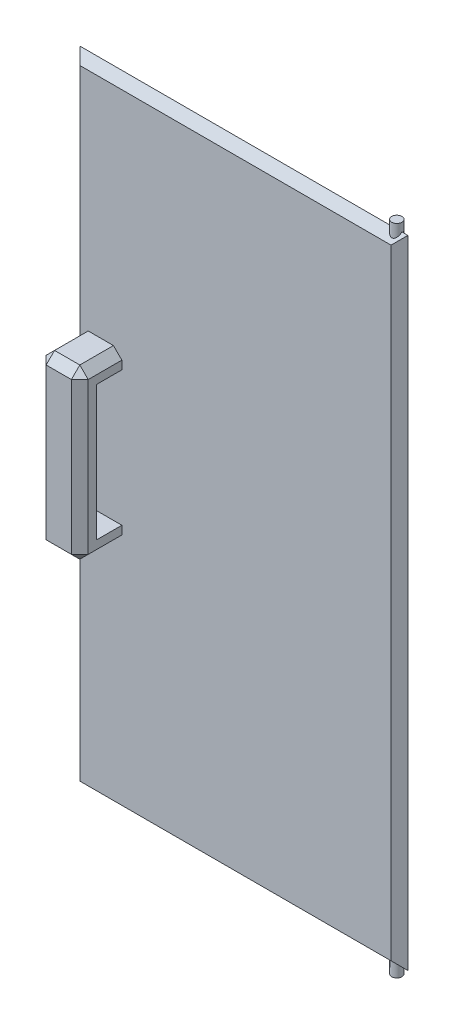
ISO-10303-21;
HEADER;
FILE_DESCRIPTION(('STEP AP214'),'2;1');
FILE_NAME('part.step','',(''),(''),'','','');
FILE_SCHEMA(('AUTOMOTIVE_DESIGN { 1 0 10303 214 1 1 1 1 }'));
ENDSEC;
DATA;
#1=APPLICATION_CONTEXT('core data for automotive mechanical design processes');
#2=APPLICATION_PROTOCOL_DEFINITION('international standard','automotive_design',2000,#1);
#3=PRODUCT_CONTEXT('',#1,'mechanical');
#4=PRODUCT('Part','Part','',(#3));
#5=PRODUCT_RELATED_PRODUCT_CATEGORY('part','',(#4));
#6=PRODUCT_DEFINITION_FORMATION('','',#4);
#7=PRODUCT_DEFINITION_CONTEXT('part definition',#1,'design');
#8=PRODUCT_DEFINITION('design','',#6,#7);
#9=PRODUCT_DEFINITION_SHAPE('','',#8);
#10=(LENGTH_UNIT() NAMED_UNIT(*) SI_UNIT(.MILLI.,.METRE.));
#11=(NAMED_UNIT(*) PLANE_ANGLE_UNIT() SI_UNIT($,.RADIAN.));
#12=(NAMED_UNIT(*) SI_UNIT($,.STERADIAN.) SOLID_ANGLE_UNIT());
#13=UNCERTAINTY_MEASURE_WITH_UNIT(LENGTH_MEASURE(1.E-05),#10,'distance_accuracy_value','');
#14=(GEOMETRIC_REPRESENTATION_CONTEXT(3) GLOBAL_UNCERTAINTY_ASSIGNED_CONTEXT((#13)) GLOBAL_UNIT_ASSIGNED_CONTEXT((#10,
#11,#12)) REPRESENTATION_CONTEXT('',''));
#15=CARTESIAN_POINT('',(0.,0.,0.));
#16=DIRECTION('',(0.,0.,1.));
#17=DIRECTION('',(1.,0.,0.));
#18=AXIS2_PLACEMENT_3D('',#15,#16,#17);
#19=CARTESIAN_POINT('',(12.8905936877682,0.,70.));
#20=DIRECTION('',(-1.,0.,0.));
#21=DIRECTION('',(0.,0.,1.));
#22=AXIS2_PLACEMENT_3D('',#19,#20,#21);
#23=PLANE('',#22);
#24=DIRECTION('',(0.,-1.,0.));
#25=VECTOR('',#24,1.);
#26=CARTESIAN_POINT('',(12.8905936877682,-458.84384057971,60.));
#27=LINE('',#26,#25);
#28=CARTESIAN_POINT('',(12.8905936877682,-268.84384057971,60.));
#29=VERTEX_POINT('',#28);
#30=CARTESIAN_POINT('',(12.8905936877682,-448.84384057971,60.));
#31=VERTEX_POINT('',#30);
#32=EDGE_CURVE('E396',#29,#31,#27,.T.);
#33=ORIENTED_EDGE('',*,*,#32,.T.);
#34=DIRECTION('',(0.,0.,-1.));
#35=VECTOR('',#34,1.);
#36=CARTESIAN_POINT('',(12.8905936877682,-448.84384057971,70.));
#37=LINE('',#36,#35);
#38=CARTESIAN_POINT('',(12.8905936877682,-448.84384057971,20.));
#39=VERTEX_POINT('',#38);
#40=EDGE_CURVE('E399',#31,#39,#37,.T.);
#41=ORIENTED_EDGE('',*,*,#40,.T.);
#42=DIRECTION('',(0.,1.,0.));
#43=VECTOR('',#42,1.);
#44=CARTESIAN_POINT('',(12.8905936877682,0.,20.));
#45=LINE('',#44,#43);
#46=CARTESIAN_POINT('',(12.8905936877682,-438.84384057971,20.));
#47=VERTEX_POINT('',#46);
#48=EDGE_CURVE('E251',#39,#47,#45,.T.);
#49=ORIENTED_EDGE('',*,*,#48,.T.);
#50=DIRECTION('',(0.,0.,-1.));
#51=VECTOR('',#50,1.);
#52=CARTESIAN_POINT('',(12.8905936877682,-438.84384057971,70.));
#53=LINE('',#52,#51);
#54=CARTESIAN_POINT('',(12.8905936877682,-438.84384057971,50.));
#55=VERTEX_POINT('',#54);
#56=EDGE_CURVE('E242',#55,#47,#53,.T.);
#57=ORIENTED_EDGE('',*,*,#56,.F.);
#58=DIRECTION('',(0.,-1.,0.));
#59=VECTOR('',#58,1.);
#60=CARTESIAN_POINT('',(12.8905936877682,0.,50.));
#61=LINE('',#60,#59);
#62=CARTESIAN_POINT('',(12.8905936877682,-278.84384057971,50.));
#63=VERTEX_POINT('',#62);
#64=EDGE_CURVE('E233',#63,#55,#61,.T.);
#65=ORIENTED_EDGE('',*,*,#64,.F.);
#66=DIRECTION('',(0.,0.,1.));
#67=VECTOR('',#66,1.);
#68=CARTESIAN_POINT('',(12.8905936877682,-278.84384057971,70.));
#69=LINE('',#68,#67);
#70=CARTESIAN_POINT('',(12.8905936877682,-278.84384057971,20.));
#71=VERTEX_POINT('',#70);
#72=EDGE_CURVE('E200',#71,#63,#69,.T.);
#73=ORIENTED_EDGE('',*,*,#72,.F.);
#74=CARTESIAN_POINT('',(12.8905936877682,-268.84384057971,20.));
#75=VERTEX_POINT('',#74);
#76=EDGE_CURVE('E250',#71,#75,#45,.T.);
#77=ORIENTED_EDGE('',*,*,#76,.T.);
#78=DIRECTION('',(0.,0.,1.));
#79=VECTOR('',#78,1.);
#80=CARTESIAN_POINT('',(12.8905936877682,-268.84384057971,70.));
#81=LINE('',#80,#79);
#82=EDGE_CURVE('E393',#75,#29,#81,.T.);
#83=ORIENTED_EDGE('',*,*,#82,.T.);
#84=EDGE_LOOP('',(#33,#41,#49,#57,#65,#73,#77,#83));
#85=FACE_BOUND('',#84,.T.);
#86=ADVANCED_FACE('F45',(#85),#23,.F.);
#87=CARTESIAN_POINT('',(-37.1094063122318,0.,70.));
#88=DIRECTION('',(1.,0.,0.));
#89=DIRECTION('',(0.,0.,-1.));
#90=AXIS2_PLACEMENT_3D('',#87,#88,#89);
#91=PLANE('',#90);
#92=DIRECTION('',(0.,-1.,0.));
#93=VECTOR('',#92,1.);
#94=CARTESIAN_POINT('',(-37.1094063122318,0.,20.));
#95=LINE('',#94,#93);
#96=CARTESIAN_POINT('',(-37.1094063122318,-438.84384057971,20.));
#97=VERTEX_POINT('',#96);
#98=CARTESIAN_POINT('',(-37.1094063122318,-448.84384057971,20.));
#99=VERTEX_POINT('',#98);
#100=EDGE_CURVE('E258',#97,#99,#95,.T.);
#101=ORIENTED_EDGE('',*,*,#100,.T.);
#102=DIRECTION('',(0.,0.,1.));
#103=VECTOR('',#102,1.);
#104=CARTESIAN_POINT('',(-37.1094063122318,-448.84384057971,70.));
#105=LINE('',#104,#103);
#106=CARTESIAN_POINT('',(-37.1094063122318,-448.84384057971,60.));
#107=VERTEX_POINT('',#106);
#108=EDGE_CURVE('E381',#99,#107,#105,.T.);
#109=ORIENTED_EDGE('',*,*,#108,.T.);
#110=DIRECTION('',(0.,1.,0.));
#111=VECTOR('',#110,1.);
#112=CARTESIAN_POINT('',(-37.1094063122318,-258.84384057971,60.));
#113=LINE('',#112,#111);
#114=CARTESIAN_POINT('',(-37.1094063122318,-268.84384057971,60.));
#115=VERTEX_POINT('',#114);
#116=EDGE_CURVE('E377',#107,#115,#113,.T.);
#117=ORIENTED_EDGE('',*,*,#116,.T.);
#118=DIRECTION('',(0.,0.,-1.));
#119=VECTOR('',#118,1.);
#120=CARTESIAN_POINT('',(-37.1094063122318,-268.84384057971,70.));
#121=LINE('',#120,#119);
#122=CARTESIAN_POINT('',(-37.1094063122318,-268.84384057971,20.));
#123=VERTEX_POINT('',#122);
#124=EDGE_CURVE('E374',#115,#123,#121,.T.);
#125=ORIENTED_EDGE('',*,*,#124,.T.);
#126=CARTESIAN_POINT('',(-37.1094063122318,-278.84384057971,20.));
#127=VERTEX_POINT('',#126);
#128=EDGE_CURVE('E220',#123,#127,#95,.T.);
#129=ORIENTED_EDGE('',*,*,#128,.T.);
#130=DIRECTION('',(0.,0.,1.));
#131=VECTOR('',#130,1.);
#132=CARTESIAN_POINT('',(-37.1094063122318,-278.84384057971,0.));
#133=LINE('',#132,#131);
#134=CARTESIAN_POINT('',(-37.1094063122318,-278.84384057971,50.));
#135=VERTEX_POINT('',#134);
#136=EDGE_CURVE('E197',#127,#135,#133,.T.);
#137=ORIENTED_EDGE('',*,*,#136,.T.);
#138=DIRECTION('',(0.,-1.,0.));
#139=VECTOR('',#138,1.);
#140=CARTESIAN_POINT('',(-37.1094063122318,0.,50.));
#141=LINE('',#140,#139);
#142=CARTESIAN_POINT('',(-37.1094063122318,-438.84384057971,50.));
#143=VERTEX_POINT('',#142);
#144=EDGE_CURVE('E209',#135,#143,#141,.T.);
#145=ORIENTED_EDGE('',*,*,#144,.T.);
#146=DIRECTION('',(0.,0.,-1.));
#147=VECTOR('',#146,1.);
#148=CARTESIAN_POINT('',(-37.1094063122318,-438.84384057971,0.));
#149=LINE('',#148,#147);
#150=EDGE_CURVE('E215',#143,#97,#149,.T.);
#151=ORIENTED_EDGE('',*,*,#150,.T.);
#152=EDGE_LOOP('',(#101,#109,#117,#125,#129,#137,#145,#151));
#153=FACE_BOUND('',#152,.T.);
#154=ADVANCED_FACE('F217',(#153),#91,.F.);
#155=CARTESIAN_POINT('',(0.,0.,20.));
#156=DIRECTION('',(0.,0.,-1.));
#157=DIRECTION('',(-1.,0.,0.));
#158=AXIS2_PLACEMENT_3D('',#155,#156,#157);
#159=PLANE('',#158);
#160=ORIENTED_EDGE('',*,*,#76,.F.);
#161=DIRECTION('',(-1.,0.,0.));
#162=VECTOR('',#161,1.);
#163=CARTESIAN_POINT('',(93.8905936877682,-278.84384057971,20.));
#164=LINE('',#163,#162);
#165=EDGE_CURVE('E204',#71,#127,#164,.T.);
#166=ORIENTED_EDGE('',*,*,#165,.T.);
#167=DIRECTION('',(0.,-1.,0.));
#168=VECTOR('',#167,1.);
#169=CARTESIAN_POINT('',(-37.1094063122318,0.,20.));
#170=LINE('',#169,#168);
#171=EDGE_CURVE('E223',#127,#97,#170,.T.);
#172=ORIENTED_EDGE('',*,*,#171,.T.);
#173=DIRECTION('',(-1.,0.,0.));
#174=VECTOR('',#173,1.);
#175=CARTESIAN_POINT('',(93.8905936877682,-438.84384057971,20.));
#176=LINE('',#175,#174);
#177=EDGE_CURVE('E230',#47,#97,#176,.T.);
#178=ORIENTED_EDGE('',*,*,#177,.F.);
#179=ORIENTED_EDGE('',*,*,#48,.F.);
#180=DIRECTION('',(0.707106781186548,0.707106781186548,0.));
#181=VECTOR('',#180,1.);
#182=CARTESIAN_POINT('',(230.867217133739,-230.867217133739,20.));
#183=LINE('',#182,#181);
#184=CARTESIAN_POINT('',(2.89059368776819,-458.84384057971,20.));
#185=VERTEX_POINT('',#184);
#186=EDGE_CURVE('E415',#39,#185,#183,.F.);
#187=ORIENTED_EDGE('',*,*,#186,.T.);
#188=DIRECTION('',(1.,0.,0.));
#189=VECTOR('',#188,1.);
#190=CARTESIAN_POINT('',(0.,-458.84384057971,20.));
#191=LINE('',#190,#189);
#192=CARTESIAN_POINT('',(-27.1094063122318,-458.84384057971,20.));
#193=VERTEX_POINT('',#192);
#194=EDGE_CURVE('E246',#193,#185,#191,.T.);
#195=ORIENTED_EDGE('',*,*,#194,.F.);
#196=DIRECTION('',(0.707106781186548,-0.707106781186548,0.));
#197=VECTOR('',#196,1.);
#198=CARTESIAN_POINT('',(-242.976623445971,-242.976623445971,20.));
#199=LINE('',#198,#197);
#200=EDGE_CURVE('E411',#193,#99,#199,.F.);
#201=ORIENTED_EDGE('',*,*,#200,.T.);
#202=DIRECTION('',(0.,-1.,0.));
#203=VECTOR('',#202,1.);
#204=CARTESIAN_POINT('',(-37.1094063122318,0.,20.));
#205=LINE('',#204,#203);
#206=CARTESIAN_POINT('',(-37.1094063122318,-727.24384057971,20.));
#207=VERTEX_POINT('',#206);
#208=EDGE_CURVE('E65',#99,#207,#205,.T.);
#209=ORIENTED_EDGE('',*,*,#208,.T.);
#210=DIRECTION('',(1.,0.,0.));
#211=VECTOR('',#210,1.);
#212=CARTESIAN_POINT('',(0.,-727.24384057971,20.));
#213=LINE('',#212,#211);
#214=CARTESIAN_POINT('',(332.890593687768,-727.24384057971,20.));
#215=VERTEX_POINT('',#214);
#216=EDGE_CURVE('E294',#207,#215,#213,.T.);
#217=ORIENTED_EDGE('',*,*,#216,.T.);
#218=DIRECTION('',(0.,1.,0.));
#219=VECTOR('',#218,1.);
#220=CARTESIAN_POINT('',(332.890593687768,0.,20.));
#221=LINE('',#220,#219);
#222=CARTESIAN_POINT('',(332.890593687768,9.55615942028985,20.));
#223=VERTEX_POINT('',#222);
#224=EDGE_CURVE('E284',#215,#223,#221,.T.);
#225=ORIENTED_EDGE('',*,*,#224,.T.);
#226=DIRECTION('',(-1.,0.,0.));
#227=VECTOR('',#226,1.);
#228=CARTESIAN_POINT('',(0.,9.55615942028985,20.));
#229=LINE('',#228,#227);
#230=CARTESIAN_POINT('',(-37.1094063122318,9.55615942028985,20.));
#231=VERTEX_POINT('',#230);
#232=EDGE_CURVE('E287',#223,#231,#229,.T.);
#233=ORIENTED_EDGE('',*,*,#232,.T.);
#234=EDGE_CURVE('E290',#231,#123,#205,.T.);
#235=ORIENTED_EDGE('',*,*,#234,.T.);
#236=DIRECTION('',(-0.707106781186548,-0.707106781186548,0.));
#237=VECTOR('',#236,1.);
#238=CARTESIAN_POINT('',(115.867217133739,-115.867217133739,20.));
#239=LINE('',#238,#237);
#240=CARTESIAN_POINT('',(-27.1094063122318,-258.84384057971,20.));
#241=VERTEX_POINT('',#240);
#242=EDGE_CURVE('E11',#123,#241,#239,.F.);
#243=ORIENTED_EDGE('',*,*,#242,.T.);
#244=DIRECTION('',(-1.,0.,0.));
#245=VECTOR('',#244,1.);
#246=CARTESIAN_POINT('',(0.,-258.84384057971,20.));
#247=LINE('',#246,#245);
#248=CARTESIAN_POINT('',(2.89059368776819,-258.84384057971,20.));
#249=VERTEX_POINT('',#248);
#250=EDGE_CURVE('E254',#249,#241,#247,.T.);
#251=ORIENTED_EDGE('',*,*,#250,.F.);
#252=DIRECTION('',(-0.707106781186548,0.707106781186548,0.));
#253=VECTOR('',#252,1.);
#254=CARTESIAN_POINT('',(-127.976623445971,-127.976623445971,20.));
#255=LINE('',#254,#253);
#256=EDGE_CURVE('E57',#249,#75,#255,.F.);
#257=ORIENTED_EDGE('',*,*,#256,.T.);
#258=EDGE_LOOP('',(#160,#166,#172,#178,#179,#187,#195,#201,#209,#217,#225,#233,#235,#243,#251,#257));
#259=FACE_BOUND('',#258,.T.);
#260=ADVANCED_FACE('F486',(#259),#159,.F.);
#261=CARTESIAN_POINT('',(0.,0.,0.));
#262=DIRECTION('',(0.,0.,-1.));
#263=DIRECTION('',(-1.,0.,0.));
#264=AXIS2_PLACEMENT_3D('',#261,#262,#263);
#265=PLANE('',#264);
#266=DIRECTION('',(0.,-1.,0.));
#267=VECTOR('',#266,1.);
#268=CARTESIAN_POINT('',(332.890593687768,-737.24384057971,0.));
#269=LINE('',#268,#267);
#270=CARTESIAN_POINT('',(332.890593687768,9.55615942028974,0.));
#271=VERTEX_POINT('',#270);
#272=CARTESIAN_POINT('',(332.890593687768,-727.24384057971,0.));
#273=VERTEX_POINT('',#272);
#274=EDGE_CURVE('E271',#271,#273,#269,.T.);
#275=ORIENTED_EDGE('',*,*,#274,.T.);
#276=DIRECTION('',(-1.,0.,0.));
#277=VECTOR('',#276,1.);
#278=CARTESIAN_POINT('',(-47.1094063122318,-727.24384057971,0.));
#279=LINE('',#278,#277);
#280=CARTESIAN_POINT('',(-37.1094063122317,-727.24384057971,0.));
#281=VERTEX_POINT('',#280);
#282=EDGE_CURVE('E280',#273,#281,#279,.T.);
#283=ORIENTED_EDGE('',*,*,#282,.T.);
#284=DIRECTION('',(0.,1.,0.));
#285=VECTOR('',#284,1.);
#286=CARTESIAN_POINT('',(-37.1094063122317,19.5561594202899,0.));
#287=LINE('',#286,#285);
#288=CARTESIAN_POINT('',(-37.1094063122317,9.55615942028974,0.));
#289=VERTEX_POINT('',#288);
#290=EDGE_CURVE('E277',#281,#289,#287,.T.);
#291=ORIENTED_EDGE('',*,*,#290,.T.);
#292=DIRECTION('',(1.,0.,0.));
#293=VECTOR('',#292,1.);
#294=CARTESIAN_POINT('',(342.890593687768,9.55615942028974,0.));
#295=LINE('',#294,#293);
#296=EDGE_CURVE('E274',#289,#271,#295,.T.);
#297=ORIENTED_EDGE('',*,*,#296,.T.);
#298=EDGE_LOOP('',(#275,#283,#291,#297));
#299=FACE_BOUND('',#298,.T.);
#300=ADVANCED_FACE('F541',(#299),#265,.T.);
#301=CARTESIAN_POINT('',(329.77827944961,29.5561594202899,9.99999999999737));
#302=DIRECTION('',(0.,-1.,0.));
#303=DIRECTION('',(0.,0.,-1.));
#304=AXIS2_PLACEMENT_3D('',#301,#302,#303);
#305=CYLINDRICAL_SURFACE('',#304,6.05000000000001);
#306=CARTESIAN_POINT('',(329.77827944961,19.5561594202871,9.99999999999737));
#307=DIRECTION('',(0.,0.707106781186547,-0.707106781186547));
#308=DIRECTION('',(0.,-0.707106781186548,-0.707106781186548));
#309=AXIS2_PLACEMENT_3D('',#306,#307,#308);
#310=ELLIPSE('',#309,8.55599205235725,6.05000000000001);
#311=CARTESIAN_POINT('',(335.82827944961,19.5561594202899,10.0000000000001));
#312=VERTEX_POINT('',#311);
#313=CARTESIAN_POINT('',(323.72827944961,19.5561594202899,10.0000000000001));
#314=VERTEX_POINT('',#313);
#315=EDGE_CURVE('E302',#312,#314,#310,.T.);
#316=ORIENTED_EDGE('',*,*,#315,.T.);
#317=CARTESIAN_POINT('',(329.77827944961,19.5561594202926,9.99999999999737));
#318=DIRECTION('',(0.,-0.707106781186544,-0.707106781186551));
#319=DIRECTION('',(0.,-0.707106781186551,0.707106781186544));
#320=AXIS2_PLACEMENT_3D('',#317,#318,#319);
#321=ELLIPSE('',#320,8.55599205235729,6.05000000000001);
#322=EDGE_CURVE('E309',#314,#312,#321,.F.);
#323=ORIENTED_EDGE('',*,*,#322,.T.);
#324=EDGE_LOOP('',(#316,#323));
#325=FACE_BOUND('',#324,.T.);
#326=CARTESIAN_POINT('',(329.77827944961,29.5561594202899,9.99999999999737));
#327=DIRECTION('',(0.,1.,0.));
#328=DIRECTION('',(0.,0.,1.));
#329=AXIS2_PLACEMENT_3D('',#326,#327,#328);
#330=CIRCLE('',#329,6.05000000000001);
#331=CARTESIAN_POINT('',(329.77827944961,29.5561594202899,16.0499999999974));
#332=VERTEX_POINT('',#331);
#333=EDGE_CURVE('E266',#332,#332,#330,.T.);
#334=ORIENTED_EDGE('',*,*,#333,.F.);
#335=EDGE_LOOP('',(#334));
#336=FACE_BOUND('',#335,.T.);
#337=ADVANCED_FACE('F537',(#325,#336),#305,.T.);
#338=CARTESIAN_POINT('',(329.77827944961,29.5561594202899,9.99999999999737));
#339=DIRECTION('',(0.,1.,0.));
#340=DIRECTION('',(0.,0.,1.));
#341=AXIS2_PLACEMENT_3D('',#338,#339,#340);
#342=PLANE('',#341);
#343=ORIENTED_EDGE('',*,*,#333,.T.);
#344=EDGE_LOOP('',(#343));
#345=FACE_BOUND('',#344,.T.);
#346=ADVANCED_FACE('F533',(#345),#342,.T.);
#347=CARTESIAN_POINT('',(329.77827944961,-747.24384057971,9.99999999999737));
#348=DIRECTION('',(0.,1.,0.));
#349=DIRECTION('',(0.,0.,1.));
#350=AXIS2_PLACEMENT_3D('',#347,#348,#349);
#351=CYLINDRICAL_SURFACE('',#350,6.05000000000001);
#352=CARTESIAN_POINT('',(329.77827944961,-737.243840579707,9.99999999999737));
#353=DIRECTION('',(0.,-0.707106781186547,-0.707106781186547));
#354=DIRECTION('',(0.,0.707106781186548,-0.707106781186548));
#355=AXIS2_PLACEMENT_3D('',#352,#353,#354);
#356=ELLIPSE('',#355,8.55599205235724,6.05000000000001);
#357=CARTESIAN_POINT('',(323.72827944961,-737.24384057971,10.0000000000001));
#358=VERTEX_POINT('',#357);
#359=CARTESIAN_POINT('',(335.82827944961,-737.24384057971,10.0000000000001));
#360=VERTEX_POINT('',#359);
#361=EDGE_CURVE('E298',#358,#360,#356,.T.);
#362=ORIENTED_EDGE('',*,*,#361,.T.);
#363=CARTESIAN_POINT('',(329.77827944961,-737.243840579713,9.99999999999737));
#364=DIRECTION('',(0.,0.707106781186544,-0.707106781186551));
#365=DIRECTION('',(0.,0.707106781186551,0.707106781186544));
#366=AXIS2_PLACEMENT_3D('',#363,#364,#365);
#367=ELLIPSE('',#366,8.55599205235729,6.05000000000001);
#368=EDGE_CURVE('E306',#360,#358,#367,.F.);
#369=ORIENTED_EDGE('',*,*,#368,.T.);
#370=EDGE_LOOP('',(#362,#369));
#371=FACE_BOUND('',#370,.T.);
#372=CARTESIAN_POINT('',(329.77827944961,-747.24384057971,9.99999999999737));
#373=DIRECTION('',(0.,-1.,0.));
#374=DIRECTION('',(0.,0.,-1.));
#375=AXIS2_PLACEMENT_3D('',#372,#373,#374);
#376=CIRCLE('',#375,6.05000000000001);
#377=CARTESIAN_POINT('',(329.77827944961,-747.24384057971,3.94999999999735));
#378=VERTEX_POINT('',#377);
#379=EDGE_CURVE('E262',#378,#378,#376,.T.);
#380=ORIENTED_EDGE('',*,*,#379,.F.);
#381=EDGE_LOOP('',(#380));
#382=FACE_BOUND('',#381,.T.);
#383=ADVANCED_FACE('F529',(#371,#382),#351,.T.);
#384=CARTESIAN_POINT('',(329.77827944961,-747.24384057971,9.99999999999737));
#385=DIRECTION('',(0.,-1.,0.));
#386=DIRECTION('',(0.,0.,-1.));
#387=AXIS2_PLACEMENT_3D('',#384,#385,#386);
#388=PLANE('',#387);
#389=ORIENTED_EDGE('',*,*,#379,.T.);
#390=EDGE_LOOP('',(#389));
#391=FACE_BOUND('',#390,.T.);
#392=ADVANCED_FACE('F525',(#391),#388,.T.);
#393=CARTESIAN_POINT('',(0.,9.55615942028985,20.));
#394=DIRECTION('',(0.,-0.707106781186544,-0.707106781186551));
#395=DIRECTION('',(-1.,0.,0.));
#396=AXIS2_PLACEMENT_3D('',#393,#394,#395);
#397=PLANE('',#396);
#398=DIRECTION('',(0.577350269189628,-0.577350269189628,0.577350269189621));
#399=VECTOR('',#398,1.);
#400=CARTESIAN_POINT('',(-24.7396042081544,-2.81364268378751,32.3698021040772));
#401=LINE('',#400,#399);
#402=CARTESIAN_POINT('',(-47.1094063122318,19.5561594202899,10.0000000000001));
#403=VERTEX_POINT('',#402);
#404=EDGE_CURVE('E267',#231,#403,#401,.F.);
#405=ORIENTED_EDGE('',*,*,#404,.F.);
#406=ORIENTED_EDGE('',*,*,#232,.F.);
#407=DIRECTION('',(-0.577350269189628,-0.577350269189628,0.577350269189621));
#408=VECTOR('',#407,1.);
#409=CARTESIAN_POINT('',(329.705207214338,6.37077294685988,23.1853864734299));
#410=LINE('',#409,#408);
#411=CARTESIAN_POINT('',(342.890593687768,19.5561594202899,10.0000000000001));
#412=VERTEX_POINT('',#411);
#413=EDGE_CURVE('E356',#412,#223,#410,.T.);
#414=ORIENTED_EDGE('',*,*,#413,.F.);
#415=DIRECTION('',(1.,0.,0.));
#416=VECTOR('',#415,1.);
#417=CARTESIAN_POINT('',(-47.1094063122318,19.5561594202899,10.0000000000001));
#418=LINE('',#417,#416);
#419=EDGE_CURVE('E352',#312,#412,#418,.T.);
#420=ORIENTED_EDGE('',*,*,#419,.F.);
#421=ORIENTED_EDGE('',*,*,#322,.F.);
#422=DIRECTION('',(1.,0.,0.));
#423=VECTOR('',#422,1.);
#424=CARTESIAN_POINT('',(-47.1094063122318,19.5561594202899,10.0000000000001));
#425=LINE('',#424,#423);
#426=EDGE_CURVE('E349',#403,#314,#425,.T.);
#427=ORIENTED_EDGE('',*,*,#426,.F.);
#428=EDGE_LOOP('',(#405,#406,#414,#420,#421,#427));
#429=FACE_BOUND('',#428,.T.);
#430=ADVANCED_FACE('F528',(#429),#397,.F.);
#431=CARTESIAN_POINT('',(-37.1094063122318,0.,20.));
#432=DIRECTION('',(0.707106781186544,0.,-0.707106781186551));
#433=DIRECTION('',(0.,-1.,0.));
#434=AXIS2_PLACEMENT_3D('',#431,#432,#433);
#435=PLANE('',#434);
#436=ORIENTED_EDGE('',*,*,#234,.F.);
#437=ORIENTED_EDGE('',*,*,#404,.T.);
#438=DIRECTION('',(0.,1.,0.));
#439=VECTOR('',#438,1.);
#440=CARTESIAN_POINT('',(-47.1094063122318,-737.24384057971,10.0000000000001));
#441=LINE('',#440,#439);
#442=CARTESIAN_POINT('',(-47.1094063122318,-737.24384057971,10.0000000000001));
#443=VERTEX_POINT('',#442);
#444=EDGE_CURVE('E341',#443,#403,#441,.T.);
#445=ORIENTED_EDGE('',*,*,#444,.F.);
#446=DIRECTION('',(0.577350269189628,0.577350269189628,0.577350269189621));
#447=VECTOR('',#446,1.);
#448=CARTESIAN_POINT('',(205.30520721434,-484.829227053138,262.414613526569));
#449=LINE('',#448,#447);
#450=EDGE_CURVE('E337',#207,#443,#449,.F.);
#451=ORIENTED_EDGE('',*,*,#450,.F.);
#452=ORIENTED_EDGE('',*,*,#208,.F.);
#453=ORIENTED_EDGE('',*,*,#100,.F.);
#454=ORIENTED_EDGE('',*,*,#171,.F.);
#455=ORIENTED_EDGE('',*,*,#128,.F.);
#456=EDGE_LOOP('',(#436,#437,#445,#451,#452,#453,#454,#455));
#457=FACE_BOUND('',#456,.T.);
#458=ADVANCED_FACE('F469',(#457),#435,.F.);
#459=CARTESIAN_POINT('',(332.890593687768,0.,20.));
#460=DIRECTION('',(-0.707106781186544,0.,-0.707106781186551));
#461=DIRECTION('',(0.,1.,0.));
#462=AXIS2_PLACEMENT_3D('',#459,#460,#461);
#463=PLANE('',#462);
#464=ORIENTED_EDGE('',*,*,#413,.T.);
#465=ORIENTED_EDGE('',*,*,#224,.F.);
#466=DIRECTION('',(0.577350269189628,-0.577350269189628,-0.577350269189621));
#467=VECTOR('',#466,1.);
#468=CARTESIAN_POINT('',(90.4759801611963,-484.829227053138,262.414613526569));
#469=LINE('',#468,#467);
#470=CARTESIAN_POINT('',(342.890593687768,-737.24384057971,10.0000000000001));
#471=VERTEX_POINT('',#470);
#472=EDGE_CURVE('E334',#471,#215,#469,.F.);
#473=ORIENTED_EDGE('',*,*,#472,.F.);
#474=DIRECTION('',(0.,-1.,0.));
#475=VECTOR('',#474,1.);
#476=CARTESIAN_POINT('',(342.890593687768,19.5561594202899,10.0000000000001));
#477=LINE('',#476,#475);
#478=EDGE_CURVE('E330',#412,#471,#477,.T.);
#479=ORIENTED_EDGE('',*,*,#478,.F.);
#480=EDGE_LOOP('',(#464,#465,#473,#479));
#481=FACE_BOUND('',#480,.T.);
#482=ADVANCED_FACE('F582',(#481),#463,.F.);
#483=CARTESIAN_POINT('',(-47.1094063122318,19.5561594202899,10.0000000000001));
#484=DIRECTION('',(0.,0.707106781186547,-0.707106781186547));
#485=DIRECTION('',(1.,0.,0.));
#486=AXIS2_PLACEMENT_3D('',#483,#484,#485);
#487=PLANE('',#486);
#488=DIRECTION('',(0.577350269189626,0.577350269189626,0.577350269189626));
#489=VECTOR('',#488,1.);
#490=CARTESIAN_POINT('',(342.890593687768,19.5561594202899,10.0000000000001));
#491=LINE('',#490,#489);
#492=EDGE_CURVE('E326',#271,#412,#491,.T.);
#493=ORIENTED_EDGE('',*,*,#492,.F.);
#494=ORIENTED_EDGE('',*,*,#296,.F.);
#495=DIRECTION('',(-0.577350269189626,0.577350269189626,0.577350269189626));
#496=VECTOR('',#495,1.);
#497=CARTESIAN_POINT('',(-47.1094063122318,19.5561594202899,10.0000000000001));
#498=LINE('',#497,#496);
#499=EDGE_CURVE('E345',#403,#289,#498,.F.);
#500=ORIENTED_EDGE('',*,*,#499,.F.);
#501=ORIENTED_EDGE('',*,*,#426,.T.);
#502=ORIENTED_EDGE('',*,*,#315,.F.);
#503=ORIENTED_EDGE('',*,*,#419,.T.);
#504=EDGE_LOOP('',(#493,#494,#500,#501,#502,#503));
#505=FACE_BOUND('',#504,.T.);
#506=ADVANCED_FACE('F575',(#505),#487,.T.);
#507=CARTESIAN_POINT('',(-47.1094063122318,-737.24384057971,10.0000000000001));
#508=DIRECTION('',(-0.707106781186547,0.,-0.707106781186547));
#509=DIRECTION('',(0.,1.,0.));
#510=AXIS2_PLACEMENT_3D('',#507,#508,#509);
#511=PLANE('',#510);
#512=ORIENTED_EDGE('',*,*,#499,.T.);
#513=ORIENTED_EDGE('',*,*,#290,.F.);
#514=DIRECTION('',(-0.577350269189626,-0.577350269189626,0.577350269189626));
#515=VECTOR('',#514,1.);
#516=CARTESIAN_POINT('',(-47.1094063122318,-737.24384057971,10.0000000000001));
#517=LINE('',#516,#515);
#518=EDGE_CURVE('E323',#443,#281,#517,.F.);
#519=ORIENTED_EDGE('',*,*,#518,.F.);
#520=ORIENTED_EDGE('',*,*,#444,.T.);
#521=EDGE_LOOP('',(#512,#513,#519,#520));
#522=FACE_BOUND('',#521,.T.);
#523=ADVANCED_FACE('F568',(#522),#511,.T.);
#524=CARTESIAN_POINT('',(0.,-727.24384057971,20.));
#525=DIRECTION('',(0.,0.707106781186544,-0.707106781186551));
#526=DIRECTION('',(1.,0.,0.));
#527=AXIS2_PLACEMENT_3D('',#524,#525,#526);
#528=PLANE('',#527);
#529=ORIENTED_EDGE('',*,*,#216,.F.);
#530=ORIENTED_EDGE('',*,*,#450,.T.);
#531=DIRECTION('',(-1.,0.,0.));
#532=VECTOR('',#531,1.);
#533=CARTESIAN_POINT('',(342.890593687768,-737.24384057971,10.0000000000001));
#534=LINE('',#533,#532);
#535=EDGE_CURVE('E319',#358,#443,#534,.T.);
#536=ORIENTED_EDGE('',*,*,#535,.F.);
#537=ORIENTED_EDGE('',*,*,#368,.F.);
#538=DIRECTION('',(-1.,0.,0.));
#539=VECTOR('',#538,1.);
#540=CARTESIAN_POINT('',(342.890593687768,-737.24384057971,10.0000000000001));
#541=LINE('',#540,#539);
#542=EDGE_CURVE('E316',#471,#360,#541,.T.);
#543=ORIENTED_EDGE('',*,*,#542,.F.);
#544=ORIENTED_EDGE('',*,*,#472,.T.);
#545=EDGE_LOOP('',(#529,#530,#536,#537,#543,#544));
#546=FACE_BOUND('',#545,.T.);
#547=ADVANCED_FACE('F561',(#546),#528,.F.);
#548=CARTESIAN_POINT('',(342.890593687768,19.5561594202899,10.0000000000001));
#549=DIRECTION('',(0.707106781186547,0.,-0.707106781186547));
#550=DIRECTION('',(0.,-1.,0.));
#551=AXIS2_PLACEMENT_3D('',#548,#549,#550);
#552=PLANE('',#551);
#553=ORIENTED_EDGE('',*,*,#492,.T.);
#554=ORIENTED_EDGE('',*,*,#478,.T.);
#555=DIRECTION('',(-0.577350269189626,0.577350269189626,-0.577350269189626));
#556=VECTOR('',#555,1.);
#557=CARTESIAN_POINT('',(90.6239270211015,-484.977173913043,-242.266666666667));
#558=LINE('',#557,#556);
#559=EDGE_CURVE('E261',#273,#471,#558,.F.);
#560=ORIENTED_EDGE('',*,*,#559,.F.);
#561=ORIENTED_EDGE('',*,*,#274,.F.);
#562=EDGE_LOOP('',(#553,#554,#560,#561));
#563=FACE_BOUND('',#562,.T.);
#564=ADVANCED_FACE('F554',(#563),#552,.T.);
#565=CARTESIAN_POINT('',(342.890593687768,-737.24384057971,10.0000000000001));
#566=DIRECTION('',(0.,-0.707106781186547,-0.707106781186547));
#567=DIRECTION('',(-1.,0.,0.));
#568=AXIS2_PLACEMENT_3D('',#565,#566,#567);
#569=PLANE('',#568);
#570=ORIENTED_EDGE('',*,*,#518,.T.);
#571=ORIENTED_EDGE('',*,*,#282,.F.);
#572=ORIENTED_EDGE('',*,*,#559,.T.);
#573=ORIENTED_EDGE('',*,*,#542,.T.);
#574=ORIENTED_EDGE('',*,*,#361,.F.);
#575=ORIENTED_EDGE('',*,*,#535,.T.);
#576=EDGE_LOOP('',(#570,#571,#572,#573,#574,#575));
#577=FACE_BOUND('',#576,.T.);
#578=ADVANCED_FACE('F523',(#577),#569,.T.);
#579=CARTESIAN_POINT('',(0.,-458.84384057971,70.));
#580=DIRECTION('',(0.,1.,0.));
#581=DIRECTION('',(0.,0.,1.));
#582=AXIS2_PLACEMENT_3D('',#579,#580,#581);
#583=PLANE('',#582);
#584=DIRECTION('',(-1.,0.,0.));
#585=VECTOR('',#584,1.);
#586=CARTESIAN_POINT('',(-37.1094063122318,-458.84384057971,60.));
#587=LINE('',#586,#585);
#588=CARTESIAN_POINT('',(2.89059368776819,-458.84384057971,60.));
#589=VERTEX_POINT('',#588);
#590=CARTESIAN_POINT('',(-27.1094063122318,-458.84384057971,60.));
#591=VERTEX_POINT('',#590);
#592=EDGE_CURVE('E387',#589,#591,#587,.T.);
#593=ORIENTED_EDGE('',*,*,#592,.T.);
#594=DIRECTION('',(0.,0.,-1.));
#595=VECTOR('',#594,1.);
#596=CARTESIAN_POINT('',(-27.1094063122318,-458.84384057971,70.));
#597=LINE('',#596,#595);
#598=EDGE_CURVE('E390',#591,#193,#597,.T.);
#599=ORIENTED_EDGE('',*,*,#598,.T.);
#600=ORIENTED_EDGE('',*,*,#194,.T.);
#601=DIRECTION('',(0.,0.,1.));
#602=VECTOR('',#601,1.);
#603=CARTESIAN_POINT('',(2.89059368776819,-458.84384057971,70.));
#604=LINE('',#603,#602);
#605=EDGE_CURVE('E384',#185,#589,#604,.T.);
#606=ORIENTED_EDGE('',*,*,#605,.T.);
#607=EDGE_LOOP('',(#593,#599,#600,#606));
#608=FACE_BOUND('',#607,.T.);
#609=ADVANCED_FACE('F520',(#608),#583,.F.);
#610=CARTESIAN_POINT('',(0.,-258.84384057971,70.));
#611=DIRECTION('',(0.,-1.,0.));
#612=DIRECTION('',(0.,0.,-1.));
#613=AXIS2_PLACEMENT_3D('',#610,#611,#612);
#614=PLANE('',#613);
#615=DIRECTION('',(1.,0.,0.));
#616=VECTOR('',#615,1.);
#617=CARTESIAN_POINT('',(12.8905936877682,-258.84384057971,60.));
#618=LINE('',#617,#616);
#619=CARTESIAN_POINT('',(-27.1094063122318,-258.84384057971,60.));
#620=VERTEX_POINT('',#619);
#621=CARTESIAN_POINT('',(2.89059368776819,-258.84384057971,60.));
#622=VERTEX_POINT('',#621);
#623=EDGE_CURVE('E405',#620,#622,#618,.T.);
#624=ORIENTED_EDGE('',*,*,#623,.T.);
#625=DIRECTION('',(0.,0.,-1.));
#626=VECTOR('',#625,1.);
#627=CARTESIAN_POINT('',(2.89059368776819,-258.84384057971,70.));
#628=LINE('',#627,#626);
#629=EDGE_CURVE('E408',#622,#249,#628,.T.);
#630=ORIENTED_EDGE('',*,*,#629,.T.);
#631=ORIENTED_EDGE('',*,*,#250,.T.);
#632=DIRECTION('',(0.,0.,1.));
#633=VECTOR('',#632,1.);
#634=CARTESIAN_POINT('',(-27.1094063122318,-258.84384057971,70.));
#635=LINE('',#634,#633);
#636=EDGE_CURVE('E402',#241,#620,#635,.T.);
#637=ORIENTED_EDGE('',*,*,#636,.T.);
#638=EDGE_LOOP('',(#624,#630,#631,#637));
#639=FACE_BOUND('',#638,.T.);
#640=ADVANCED_FACE('F483',(#639),#614,.F.);
#641=CARTESIAN_POINT('',(0.,0.,70.));
#642=DIRECTION('',(0.,0.,1.));
#643=DIRECTION('',(1.,0.,0.));
#644=AXIS2_PLACEMENT_3D('',#641,#642,#643);
#645=PLANE('',#644);
#646=DIRECTION('',(-1.,0.,0.));
#647=VECTOR('',#646,1.);
#648=CARTESIAN_POINT('',(-37.1094063122318,-268.84384057971,70.));
#649=LINE('',#648,#647);
#650=CARTESIAN_POINT('',(2.89059368776819,-268.84384057971,70.));
#651=VERTEX_POINT('',#650);
#652=CARTESIAN_POINT('',(-27.1094063122318,-268.84384057971,70.));
#653=VERTEX_POINT('',#652);
#654=EDGE_CURVE('E312',#651,#653,#649,.T.);
#655=ORIENTED_EDGE('',*,*,#654,.T.);
#656=DIRECTION('',(0.,-1.,0.));
#657=VECTOR('',#656,1.);
#658=CARTESIAN_POINT('',(-27.1094063122318,-458.84384057971,70.));
#659=LINE('',#658,#657);
#660=CARTESIAN_POINT('',(-27.1094063122318,-448.84384057971,70.));
#661=VERTEX_POINT('',#660);
#662=EDGE_CURVE('E370',#653,#661,#659,.T.);
#663=ORIENTED_EDGE('',*,*,#662,.T.);
#664=DIRECTION('',(1.,0.,0.));
#665=VECTOR('',#664,1.);
#666=CARTESIAN_POINT('',(12.8905936877682,-448.84384057971,70.));
#667=LINE('',#666,#665);
#668=CARTESIAN_POINT('',(2.89059368776819,-448.84384057971,70.));
#669=VERTEX_POINT('',#668);
#670=EDGE_CURVE('E367',#661,#669,#667,.T.);
#671=ORIENTED_EDGE('',*,*,#670,.T.);
#672=DIRECTION('',(0.,1.,0.));
#673=VECTOR('',#672,1.);
#674=CARTESIAN_POINT('',(2.89059368776819,-258.84384057971,70.));
#675=LINE('',#674,#673);
#676=EDGE_CURVE('E364',#669,#651,#675,.T.);
#677=ORIENTED_EDGE('',*,*,#676,.T.);
#678=EDGE_LOOP('',(#655,#663,#671,#677));
#679=FACE_BOUND('',#678,.T.);
#680=ADVANCED_FACE('F676',(#679),#645,.T.);
#681=CARTESIAN_POINT('',(93.8905936877682,-438.84384057971,0.));
#682=DIRECTION('',(0.,1.,0.));
#683=DIRECTION('',(0.,0.,1.));
#684=AXIS2_PLACEMENT_3D('',#681,#682,#683);
#685=PLANE('',#684);
#686=ORIENTED_EDGE('',*,*,#56,.T.);
#687=ORIENTED_EDGE('',*,*,#177,.T.);
#688=ORIENTED_EDGE('',*,*,#150,.F.);
#689=DIRECTION('',(-1.,0.,0.));
#690=VECTOR('',#689,1.);
#691=CARTESIAN_POINT('',(93.8905936877682,-438.84384057971,50.));
#692=LINE('',#691,#690);
#693=EDGE_CURVE('E205',#55,#143,#692,.T.);
#694=ORIENTED_EDGE('',*,*,#693,.F.);
#695=EDGE_LOOP('',(#686,#687,#688,#694));
#696=FACE_BOUND('',#695,.T.);
#697=ADVANCED_FACE('F674',(#696),#685,.T.);
#698=CARTESIAN_POINT('',(93.8905936877682,-278.84384057971,0.));
#699=DIRECTION('',(0.,-1.,0.));
#700=DIRECTION('',(0.,0.,-1.));
#701=AXIS2_PLACEMENT_3D('',#698,#699,#700);
#702=PLANE('',#701);
#703=ORIENTED_EDGE('',*,*,#72,.T.);
#704=DIRECTION('',(-1.,0.,0.));
#705=VECTOR('',#704,1.);
#706=CARTESIAN_POINT('',(93.8905936877682,-278.84384057971,50.));
#707=LINE('',#706,#705);
#708=EDGE_CURVE('E193',#63,#135,#707,.T.);
#709=ORIENTED_EDGE('',*,*,#708,.T.);
#710=ORIENTED_EDGE('',*,*,#136,.F.);
#711=ORIENTED_EDGE('',*,*,#165,.F.);
#712=EDGE_LOOP('',(#703,#709,#710,#711));
#713=FACE_BOUND('',#712,.T.);
#714=ADVANCED_FACE('F195',(#713),#702,.T.);
#715=CARTESIAN_POINT('',(93.8905936877682,0.,50.));
#716=DIRECTION('',(0.,0.,-1.));
#717=DIRECTION('',(-1.,0.,0.));
#718=AXIS2_PLACEMENT_3D('',#715,#716,#717);
#719=PLANE('',#718);
#720=ORIENTED_EDGE('',*,*,#64,.T.);
#721=ORIENTED_EDGE('',*,*,#693,.T.);
#722=ORIENTED_EDGE('',*,*,#144,.F.);
#723=ORIENTED_EDGE('',*,*,#708,.F.);
#724=EDGE_LOOP('',(#720,#721,#722,#723));
#725=FACE_BOUND('',#724,.T.);
#726=ADVANCED_FACE('F210',(#725),#719,.T.);
#727=CARTESIAN_POINT('',(2.89059368776819,-258.84384057971,70.));
#728=DIRECTION('',(-0.707106781186547,-0.707106781186547,0.));
#729=DIRECTION('',(0.,0.,-1.));
#730=AXIS2_PLACEMENT_3D('',#727,#728,#729);
#731=PLANE('',#730);
#732=ORIENTED_EDGE('',*,*,#256,.F.);
#733=ORIENTED_EDGE('',*,*,#629,.F.);
#734=DIRECTION('',(0.707106781186547,-0.707106781186547,0.));
#735=VECTOR('',#734,1.);
#736=CARTESIAN_POINT('',(7.89059368776819,-263.84384057971,60.));
#737=LINE('',#736,#735);
#738=EDGE_CURVE('E50',#29,#622,#737,.F.);
#739=ORIENTED_EDGE('',*,*,#738,.F.);
#740=ORIENTED_EDGE('',*,*,#82,.F.);
#741=EDGE_LOOP('',(#732,#733,#739,#740));
#742=FACE_BOUND('',#741,.T.);
#743=ADVANCED_FACE('F48',(#742),#731,.F.);
#744=CARTESIAN_POINT('',(2.89059368776819,0.,70.));
#745=DIRECTION('',(0.707106781186547,0.,0.707106781186547));
#746=DIRECTION('',(0.,-1.,0.));
#747=AXIS2_PLACEMENT_3D('',#744,#745,#746);
#748=PLANE('',#747);
#749=DIRECTION('',(-0.707106781186547,0.,0.707106781186547));
#750=VECTOR('',#749,1.);
#751=CARTESIAN_POINT('',(2.89059368776819,-448.84384057971,70.));
#752=LINE('',#751,#750);
#753=EDGE_CURVE('E454',#31,#669,#752,.T.);
#754=ORIENTED_EDGE('',*,*,#753,.F.);
#755=ORIENTED_EDGE('',*,*,#32,.F.);
#756=DIRECTION('',(0.707106781186547,0.,-0.707106781186547));
#757=VECTOR('',#756,1.);
#758=CARTESIAN_POINT('',(2.89059368776819,-268.84384057971,70.));
#759=LINE('',#758,#757);
#760=EDGE_CURVE('E457',#651,#29,#759,.T.);
#761=ORIENTED_EDGE('',*,*,#760,.F.);
#762=ORIENTED_EDGE('',*,*,#676,.F.);
#763=EDGE_LOOP('',(#754,#755,#761,#762));
#764=FACE_BOUND('',#763,.T.);
#765=ADVANCED_FACE('F508',(#764),#748,.T.);
#766=CARTESIAN_POINT('',(12.8905936877682,-448.84384057971,70.));
#767=DIRECTION('',(-0.707106781186547,0.707106781186547,0.));
#768=DIRECTION('',(0.,0.,-1.));
#769=AXIS2_PLACEMENT_3D('',#766,#767,#768);
#770=PLANE('',#769);
#771=ORIENTED_EDGE('',*,*,#186,.F.);
#772=ORIENTED_EDGE('',*,*,#40,.F.);
#773=DIRECTION('',(-0.707106781186547,-0.707106781186547,0.));
#774=VECTOR('',#773,1.);
#775=CARTESIAN_POINT('',(7.89059368776819,-453.84384057971,60.));
#776=LINE('',#775,#774);
#777=EDGE_CURVE('E450',#589,#31,#776,.F.);
#778=ORIENTED_EDGE('',*,*,#777,.F.);
#779=ORIENTED_EDGE('',*,*,#605,.F.);
#780=EDGE_LOOP('',(#771,#772,#778,#779));
#781=FACE_BOUND('',#780,.T.);
#782=ADVANCED_FACE('F500',(#781),#770,.F.);
#783=CARTESIAN_POINT('',(2.89059368776819,-268.84384057971,70.));
#784=DIRECTION('',(0.577350269189626,0.577350269189626,0.577350269189626));
#785=DIRECTION('',(0.707106781186547,0.,-0.707106781186547));
#786=AXIS2_PLACEMENT_3D('',#783,#784,#785);
#787=PLANE('',#786);
#788=ORIENTED_EDGE('',*,*,#760,.T.);
#789=ORIENTED_EDGE('',*,*,#738,.T.);
#790=DIRECTION('',(0.,-0.707106781186547,0.707106781186547));
#791=VECTOR('',#790,1.);
#792=CARTESIAN_POINT('',(2.89059368776819,-268.84384057971,70.));
#793=LINE('',#792,#791);
#794=EDGE_CURVE('E446',#651,#622,#793,.F.);
#795=ORIENTED_EDGE('',*,*,#794,.F.);
#796=EDGE_LOOP('',(#788,#789,#795));
#797=FACE_BOUND('',#796,.T.);
#798=ADVANCED_FACE('F497',(#797),#787,.T.);
#799=CARTESIAN_POINT('',(2.89059368776819,-448.84384057971,70.));
#800=DIRECTION('',(0.577350269189626,-0.577350269189626,0.577350269189626));
#801=DIRECTION('',(0.707106781186547,0.,-0.707106781186547));
#802=AXIS2_PLACEMENT_3D('',#799,#800,#801);
#803=PLANE('',#802);
#804=ORIENTED_EDGE('',*,*,#777,.T.);
#805=ORIENTED_EDGE('',*,*,#753,.T.);
#806=DIRECTION('',(0.,-0.707106781186547,-0.707106781186547));
#807=VECTOR('',#806,1.);
#808=CARTESIAN_POINT('',(2.89059368776819,-448.84384057971,70.));
#809=LINE('',#808,#807);
#810=EDGE_CURVE('E442',#589,#669,#809,.F.);
#811=ORIENTED_EDGE('',*,*,#810,.F.);
#812=EDGE_LOOP('',(#804,#805,#811));
#813=FACE_BOUND('',#812,.T.);
#814=ADVANCED_FACE('F499',(#813),#803,.T.);
#815=CARTESIAN_POINT('',(-37.1094063122318,-268.84384057971,70.));
#816=DIRECTION('',(0.707106781186547,-0.707106781186547,0.));
#817=DIRECTION('',(0.,0.,-1.));
#818=AXIS2_PLACEMENT_3D('',#815,#816,#817);
#819=PLANE('',#818);
#820=ORIENTED_EDGE('',*,*,#242,.F.);
#821=ORIENTED_EDGE('',*,*,#124,.F.);
#822=DIRECTION('',(0.707106781186547,0.707106781186547,0.));
#823=VECTOR('',#822,1.);
#824=CARTESIAN_POINT('',(-37.1094063122318,-268.84384057971,60.));
#825=LINE('',#824,#823);
#826=EDGE_CURVE('E438',#620,#115,#825,.F.);
#827=ORIENTED_EDGE('',*,*,#826,.F.);
#828=ORIENTED_EDGE('',*,*,#636,.F.);
#829=EDGE_LOOP('',(#820,#821,#827,#828));
#830=FACE_BOUND('',#829,.T.);
#831=ADVANCED_FACE('F490',(#830),#819,.F.);
#832=CARTESIAN_POINT('',(0.,-268.84384057971,70.));
#833=DIRECTION('',(0.,0.707106781186547,0.707106781186547));
#834=DIRECTION('',(1.,0.,0.));
#835=AXIS2_PLACEMENT_3D('',#832,#833,#834);
#836=PLANE('',#835);
#837=ORIENTED_EDGE('',*,*,#794,.T.);
#838=ORIENTED_EDGE('',*,*,#623,.F.);
#839=DIRECTION('',(0.,0.707106781186547,-0.707106781186547));
#840=VECTOR('',#839,1.);
#841=CARTESIAN_POINT('',(-27.1094063122318,-263.84384057971,65.));
#842=LINE('',#841,#840);
#843=EDGE_CURVE('E434',#653,#620,#842,.T.);
#844=ORIENTED_EDGE('',*,*,#843,.F.);
#845=ORIENTED_EDGE('',*,*,#654,.F.);
#846=EDGE_LOOP('',(#837,#838,#844,#845));
#847=FACE_BOUND('',#846,.T.);
#848=ADVANCED_FACE('F494',(#847),#836,.T.);
#849=CARTESIAN_POINT('',(0.,-448.84384057971,70.));
#850=DIRECTION('',(0.,-0.707106781186547,0.707106781186547));
#851=DIRECTION('',(-1.,0.,0.));
#852=AXIS2_PLACEMENT_3D('',#849,#850,#851);
#853=PLANE('',#852);
#854=ORIENTED_EDGE('',*,*,#810,.T.);
#855=ORIENTED_EDGE('',*,*,#670,.F.);
#856=DIRECTION('',(0.,0.707106781186547,0.707106781186547));
#857=VECTOR('',#856,1.);
#858=CARTESIAN_POINT('',(-27.1094063122318,-448.84384057971,70.));
#859=LINE('',#858,#857);
#860=EDGE_CURVE('E430',#591,#661,#859,.T.);
#861=ORIENTED_EDGE('',*,*,#860,.F.);
#862=ORIENTED_EDGE('',*,*,#592,.F.);
#863=EDGE_LOOP('',(#854,#855,#861,#862));
#864=FACE_BOUND('',#863,.T.);
#865=ADVANCED_FACE('F628',(#864),#853,.T.);
#866=CARTESIAN_POINT('',(-27.1094063122318,-458.84384057971,70.));
#867=DIRECTION('',(0.707106781186547,0.707106781186547,0.));
#868=DIRECTION('',(0.,0.,-1.));
#869=AXIS2_PLACEMENT_3D('',#866,#867,#868);
#870=PLANE('',#869);
#871=ORIENTED_EDGE('',*,*,#200,.F.);
#872=ORIENTED_EDGE('',*,*,#598,.F.);
#873=DIRECTION('',(-0.707106781186547,0.707106781186547,0.));
#874=VECTOR('',#873,1.);
#875=CARTESIAN_POINT('',(-32.1094063122318,-453.84384057971,60.));
#876=LINE('',#875,#874);
#877=EDGE_CURVE('E426',#107,#591,#876,.F.);
#878=ORIENTED_EDGE('',*,*,#877,.F.);
#879=ORIENTED_EDGE('',*,*,#108,.F.);
#880=EDGE_LOOP('',(#871,#872,#878,#879));
#881=FACE_BOUND('',#880,.T.);
#882=ADVANCED_FACE('F621',(#881),#870,.F.);
#883=CARTESIAN_POINT('',(-37.1094063122318,-268.84384057971,60.));
#884=DIRECTION('',(-0.577350269189626,0.577350269189626,0.577350269189626));
#885=DIRECTION('',(0.707106781186547,0.,0.707106781186547));
#886=AXIS2_PLACEMENT_3D('',#883,#884,#885);
#887=PLANE('',#886);
#888=ORIENTED_EDGE('',*,*,#843,.T.);
#889=ORIENTED_EDGE('',*,*,#826,.T.);
#890=DIRECTION('',(0.707106781186547,0.,0.707106781186547));
#891=VECTOR('',#890,1.);
#892=CARTESIAN_POINT('',(-37.1094063122318,-268.84384057971,60.));
#893=LINE('',#892,#891);
#894=EDGE_CURVE('E423',#653,#115,#893,.F.);
#895=ORIENTED_EDGE('',*,*,#894,.F.);
#896=EDGE_LOOP('',(#888,#889,#895));
#897=FACE_BOUND('',#896,.T.);
#898=ADVANCED_FACE('F614',(#897),#887,.T.);
#899=CARTESIAN_POINT('',(-27.1094063122318,-448.84384057971,70.));
#900=DIRECTION('',(-0.577350269189626,-0.577350269189626,0.577350269189626));
#901=DIRECTION('',(0.707106781186547,0.,0.707106781186547));
#902=AXIS2_PLACEMENT_3D('',#899,#900,#901);
#903=PLANE('',#902);
#904=ORIENTED_EDGE('',*,*,#877,.T.);
#905=ORIENTED_EDGE('',*,*,#860,.T.);
#906=DIRECTION('',(-0.707106781186547,0.,-0.707106781186547));
#907=VECTOR('',#906,1.);
#908=CARTESIAN_POINT('',(-27.1094063122318,-448.84384057971,70.));
#909=LINE('',#908,#907);
#910=EDGE_CURVE('E420',#107,#661,#909,.F.);
#911=ORIENTED_EDGE('',*,*,#910,.F.);
#912=EDGE_LOOP('',(#904,#905,#911));
#913=FACE_BOUND('',#912,.T.);
#914=ADVANCED_FACE('F607',(#913),#903,.T.);
#915=CARTESIAN_POINT('',(-27.1094063122318,0.,70.));
#916=DIRECTION('',(-0.707106781186547,0.,0.707106781186547));
#917=DIRECTION('',(0.,1.,0.));
#918=AXIS2_PLACEMENT_3D('',#915,#916,#917);
#919=PLANE('',#918);
#920=ORIENTED_EDGE('',*,*,#894,.T.);
#921=ORIENTED_EDGE('',*,*,#116,.F.);
#922=ORIENTED_EDGE('',*,*,#910,.T.);
#923=ORIENTED_EDGE('',*,*,#662,.F.);
#924=EDGE_LOOP('',(#920,#921,#922,#923));
#925=FACE_BOUND('',#924,.T.);
#926=ADVANCED_FACE('F601',(#925),#919,.T.);
#927=CLOSED_SHELL('',(#86,#154,#260,#300,#337,#346,#383,#392,#430,#458,#482,#506,#523,#547,#564,
#578,#609,#640,#680,#697,#714,#726,#743,#765,#782,#798,#814,#831,#848,#865,#882,#898,#914,#926));
#928=MANIFOLD_SOLID_BREP('B2',#927);
#929=ADVANCED_BREP_SHAPE_REPRESENTATION('',(#18,#928),#14);
#930=SHAPE_DEFINITION_REPRESENTATION(#9,#929);
ENDSEC;
END-ISO-10303-21;
